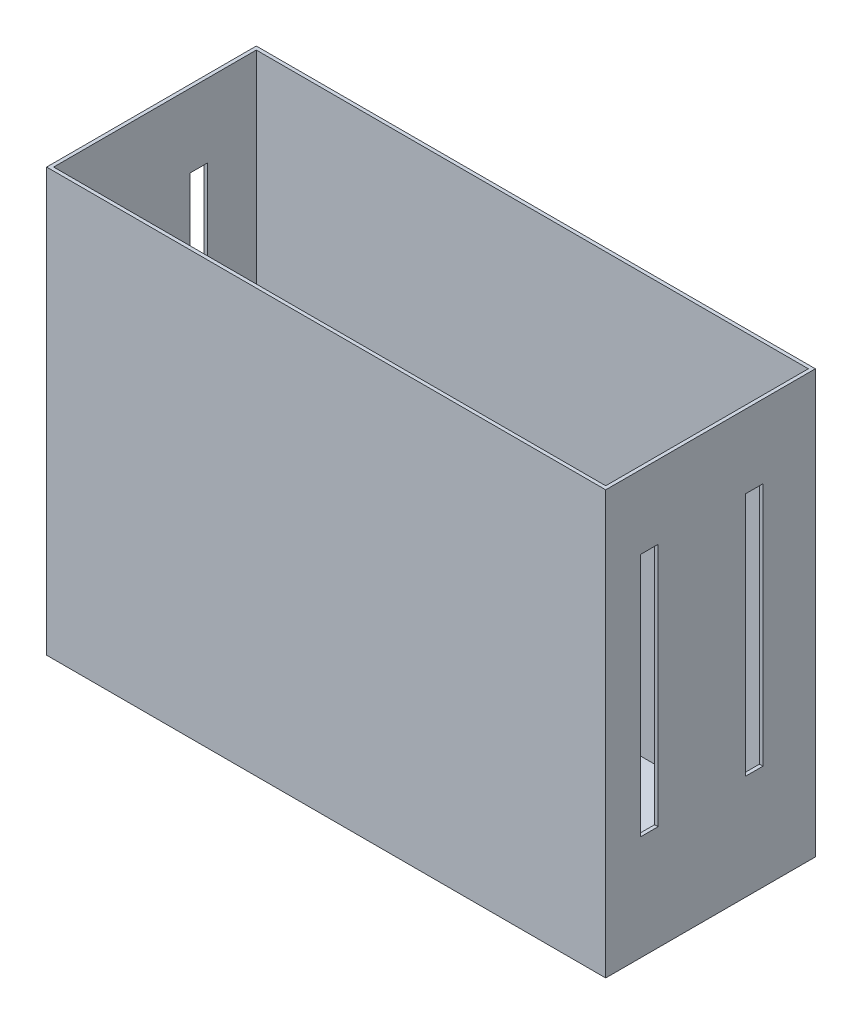
ISO-10303-21;
HEADER;
FILE_DESCRIPTION(('STEP AP214'),'2;1');
FILE_NAME('part.step','',(''),(''),'','','');
FILE_SCHEMA(('AUTOMOTIVE_DESIGN { 1 0 10303 214 1 1 1 1 }'));
ENDSEC;
DATA;
#1=APPLICATION_CONTEXT('core data for automotive mechanical design processes');
#2=APPLICATION_PROTOCOL_DEFINITION('international standard','automotive_design',2000,#1);
#3=PRODUCT_CONTEXT('',#1,'mechanical');
#4=PRODUCT('Part','Part','',(#3));
#5=PRODUCT_RELATED_PRODUCT_CATEGORY('part','',(#4));
#6=PRODUCT_DEFINITION_FORMATION('','',#4);
#7=PRODUCT_DEFINITION_CONTEXT('part definition',#1,'design');
#8=PRODUCT_DEFINITION('design','',#6,#7);
#9=PRODUCT_DEFINITION_SHAPE('','',#8);
#10=(LENGTH_UNIT() NAMED_UNIT(*) SI_UNIT(.MILLI.,.METRE.));
#11=(NAMED_UNIT(*) PLANE_ANGLE_UNIT() SI_UNIT($,.RADIAN.));
#12=(NAMED_UNIT(*) SI_UNIT($,.STERADIAN.) SOLID_ANGLE_UNIT());
#13=UNCERTAINTY_MEASURE_WITH_UNIT(LENGTH_MEASURE(1.E-05),#10,'distance_accuracy_value','');
#14=(GEOMETRIC_REPRESENTATION_CONTEXT(3) GLOBAL_UNCERTAINTY_ASSIGNED_CONTEXT((#13)) GLOBAL_UNIT_ASSIGNED_CONTEXT((#10,
#11,#12)) REPRESENTATION_CONTEXT('',''));
#15=CARTESIAN_POINT('',(0.,0.,0.));
#16=DIRECTION('',(0.,0.,1.));
#17=DIRECTION('',(1.,0.,0.));
#18=AXIS2_PLACEMENT_3D('',#15,#16,#17);
#19=CARTESIAN_POINT('',(0.,304.8,0.));
#20=DIRECTION('',(0.,1.,0.));
#21=DIRECTION('',(0.,0.,1.));
#22=AXIS2_PLACEMENT_3D('',#19,#20,#21);
#23=PLANE('',#22);
#24=DIRECTION('',(0.,0.,1.));
#25=VECTOR('',#24,1.);
#26=CARTESIAN_POINT('',(-203.2,304.8,-76.2));
#27=LINE('',#26,#25);
#28=CARTESIAN_POINT('',(-203.2,304.8,-76.2));
#29=VERTEX_POINT('',#28);
#30=CARTESIAN_POINT('',(-203.2,304.8,76.2));
#31=VERTEX_POINT('',#30);
#32=EDGE_CURVE('E346',#29,#31,#27,.T.);
#33=ORIENTED_EDGE('',*,*,#32,.T.);
#34=DIRECTION('',(1.,0.,0.));
#35=VECTOR('',#34,1.);
#36=CARTESIAN_POINT('',(-203.2,304.8,76.2));
#37=LINE('',#36,#35);
#38=CARTESIAN_POINT('',(203.2,304.8,76.2));
#39=VERTEX_POINT('',#38);
#40=EDGE_CURVE('E349',#31,#39,#37,.T.);
#41=ORIENTED_EDGE('',*,*,#40,.T.);
#42=DIRECTION('',(0.,0.,-1.));
#43=VECTOR('',#42,1.);
#44=CARTESIAN_POINT('',(203.2,304.8,-76.2));
#45=LINE('',#44,#43);
#46=CARTESIAN_POINT('',(203.2,304.8,-76.2));
#47=VERTEX_POINT('',#46);
#48=EDGE_CURVE('E351',#39,#47,#45,.T.);
#49=ORIENTED_EDGE('',*,*,#48,.T.);
#50=DIRECTION('',(-1.,0.,0.));
#51=VECTOR('',#50,1.);
#52=CARTESIAN_POINT('',(-203.2,304.8,-76.2));
#53=LINE('',#52,#51);
#54=EDGE_CURVE('E353',#47,#29,#53,.T.);
#55=ORIENTED_EDGE('',*,*,#54,.T.);
#56=EDGE_LOOP('',(#33,#41,#49,#55));
#57=FACE_BOUND('',#56,.T.);
#58=DIRECTION('',(1.,0.,0.));
#59=VECTOR('',#58,1.);
#60=CARTESIAN_POINT('',(-200.66,304.8,73.66));
#61=LINE('',#60,#59);
#62=CARTESIAN_POINT('',(-200.66,304.8,73.66));
#63=VERTEX_POINT('',#62);
#64=CARTESIAN_POINT('',(200.66,304.8,73.66));
#65=VERTEX_POINT('',#64);
#66=EDGE_CURVE('E319',#63,#65,#61,.T.);
#67=ORIENTED_EDGE('',*,*,#66,.F.);
#68=DIRECTION('',(0.,0.,1.));
#69=VECTOR('',#68,1.);
#70=CARTESIAN_POINT('',(-200.66,304.8,-73.66));
#71=LINE('',#70,#69);
#72=CARTESIAN_POINT('',(-200.66,304.8,-73.66));
#73=VERTEX_POINT('',#72);
#74=EDGE_CURVE('E317',#73,#63,#71,.T.);
#75=ORIENTED_EDGE('',*,*,#74,.F.);
#76=DIRECTION('',(-1.,0.,0.));
#77=VECTOR('',#76,1.);
#78=CARTESIAN_POINT('',(-200.66,304.8,-73.66));
#79=LINE('',#78,#77);
#80=CARTESIAN_POINT('',(200.66,304.8,-73.66));
#81=VERTEX_POINT('',#80);
#82=EDGE_CURVE('E325',#81,#73,#79,.T.);
#83=ORIENTED_EDGE('',*,*,#82,.F.);
#84=DIRECTION('',(0.,0.,-1.));
#85=VECTOR('',#84,1.);
#86=CARTESIAN_POINT('',(200.66,304.8,-73.66));
#87=LINE('',#86,#85);
#88=EDGE_CURVE('E322',#65,#81,#87,.T.);
#89=ORIENTED_EDGE('',*,*,#88,.F.);
#90=EDGE_LOOP('',(#67,#75,#83,#89));
#91=FACE_BOUND('',#90,.T.);
#92=ADVANCED_FACE('F38',(#57,#91),#23,.T.);
#93=CARTESIAN_POINT('',(-203.2,304.8,-76.2));
#94=DIRECTION('',(1.,0.,0.));
#95=DIRECTION('',(0.,0.,-1.));
#96=AXIS2_PLACEMENT_3D('',#93,#94,#95);
#97=PLANE('',#96);
#98=DIRECTION('',(0.,0.,-1.));
#99=VECTOR('',#98,1.);
#100=CARTESIAN_POINT('',(-203.2,73.66,-76.2));
#101=LINE('',#100,#99);
#102=CARTESIAN_POINT('',(-203.2,73.66,50.8));
#103=VERTEX_POINT('',#102);
#104=CARTESIAN_POINT('',(-203.2,73.66,38.1));
#105=VERTEX_POINT('',#104);
#106=EDGE_CURVE('E285',#103,#105,#101,.T.);
#107=ORIENTED_EDGE('',*,*,#106,.T.);
#108=DIRECTION('',(0.,1.,0.));
#109=VECTOR('',#108,1.);
#110=CARTESIAN_POINT('',(-203.2,304.8,38.1));
#111=LINE('',#110,#109);
#112=CARTESIAN_POINT('',(-203.2,251.46,38.1));
#113=VERTEX_POINT('',#112);
#114=EDGE_CURVE('E301',#105,#113,#111,.T.);
#115=ORIENTED_EDGE('',*,*,#114,.T.);
#116=DIRECTION('',(0.,0.,1.));
#117=VECTOR('',#116,1.);
#118=CARTESIAN_POINT('',(-203.2,251.46,-76.2));
#119=LINE('',#118,#117);
#120=CARTESIAN_POINT('',(-203.2,251.46,50.8));
#121=VERTEX_POINT('',#120);
#122=EDGE_CURVE('E296',#113,#121,#119,.T.);
#123=ORIENTED_EDGE('',*,*,#122,.T.);
#124=DIRECTION('',(0.,-1.,0.));
#125=VECTOR('',#124,1.);
#126=CARTESIAN_POINT('',(-203.2,304.8,50.8));
#127=LINE('',#126,#125);
#128=EDGE_CURVE('E291',#121,#103,#127,.T.);
#129=ORIENTED_EDGE('',*,*,#128,.T.);
#130=EDGE_LOOP('',(#107,#115,#123,#129));
#131=FACE_BOUND('',#130,.T.);
#132=DIRECTION('',(0.,0.,-1.));
#133=VECTOR('',#132,1.);
#134=CARTESIAN_POINT('',(-203.2,73.6600000000001,-76.2000000000003));
#135=LINE('',#134,#133);
#136=CARTESIAN_POINT('',(-203.2,73.66,-25.4));
#137=VERTEX_POINT('',#136);
#138=CARTESIAN_POINT('',(-203.2,73.66,-38.1));
#139=VERTEX_POINT('',#138);
#140=EDGE_CURVE('E264',#137,#139,#135,.T.);
#141=ORIENTED_EDGE('',*,*,#140,.T.);
#142=DIRECTION('',(0.,1.,0.));
#143=VECTOR('',#142,1.);
#144=CARTESIAN_POINT('',(-203.2,304.8,-38.1));
#145=LINE('',#144,#143);
#146=CARTESIAN_POINT('',(-203.2,251.46,-38.1));
#147=VERTEX_POINT('',#146);
#148=EDGE_CURVE('E280',#139,#147,#145,.T.);
#149=ORIENTED_EDGE('',*,*,#148,.T.);
#150=DIRECTION('',(0.,0.,1.));
#151=VECTOR('',#150,1.);
#152=CARTESIAN_POINT('',(-203.2,251.46,-76.2));
#153=LINE('',#152,#151);
#154=CARTESIAN_POINT('',(-203.2,251.46,-25.4));
#155=VERTEX_POINT('',#154);
#156=EDGE_CURVE('E275',#147,#155,#153,.T.);
#157=ORIENTED_EDGE('',*,*,#156,.T.);
#158=DIRECTION('',(0.,-1.,0.));
#159=VECTOR('',#158,1.);
#160=CARTESIAN_POINT('',(-203.2,304.8,-25.4));
#161=LINE('',#160,#159);
#162=EDGE_CURVE('E270',#155,#137,#161,.T.);
#163=ORIENTED_EDGE('',*,*,#162,.T.);
#164=EDGE_LOOP('',(#141,#149,#157,#163));
#165=FACE_BOUND('',#164,.T.);
#166=DIRECTION('',(0.,-1.,0.));
#167=VECTOR('',#166,1.);
#168=CARTESIAN_POINT('',(-203.2,304.8,-76.2));
#169=LINE('',#168,#167);
#170=CARTESIAN_POINT('',(-203.2,-2.54,-76.2));
#171=VERTEX_POINT('',#170);
#172=EDGE_CURVE('E355',#29,#171,#169,.T.);
#173=ORIENTED_EDGE('',*,*,#172,.T.);
#174=DIRECTION('',(0.,0.,-1.));
#175=VECTOR('',#174,1.);
#176=CARTESIAN_POINT('',(-203.2,-2.54,-76.2));
#177=LINE('',#176,#175);
#178=CARTESIAN_POINT('',(-203.2,-2.54,76.2));
#179=VERTEX_POINT('',#178);
#180=EDGE_CURVE('E307',#179,#171,#177,.T.);
#181=ORIENTED_EDGE('',*,*,#180,.F.);
#182=DIRECTION('',(0.,-1.,0.));
#183=VECTOR('',#182,1.);
#184=CARTESIAN_POINT('',(-203.2,304.8,76.2));
#185=LINE('',#184,#183);
#186=EDGE_CURVE('E361',#31,#179,#185,.T.);
#187=ORIENTED_EDGE('',*,*,#186,.F.);
#188=ORIENTED_EDGE('',*,*,#32,.F.);
#189=EDGE_LOOP('',(#173,#181,#187,#188));
#190=FACE_BOUND('',#189,.T.);
#191=ADVANCED_FACE('F40',(#131,#165,#190),#97,.F.);
#192=CARTESIAN_POINT('',(-203.2,304.8,76.2));
#193=DIRECTION('',(0.,0.,-1.));
#194=DIRECTION('',(-1.,0.,0.));
#195=AXIS2_PLACEMENT_3D('',#192,#193,#194);
#196=PLANE('',#195);
#197=ORIENTED_EDGE('',*,*,#186,.T.);
#198=DIRECTION('',(-1.,0.,0.));
#199=VECTOR('',#198,1.);
#200=CARTESIAN_POINT('',(-203.2,-2.54,76.2));
#201=LINE('',#200,#199);
#202=CARTESIAN_POINT('',(203.2,-2.54,76.2));
#203=VERTEX_POINT('',#202);
#204=EDGE_CURVE('E304',#203,#179,#201,.T.);
#205=ORIENTED_EDGE('',*,*,#204,.F.);
#206=DIRECTION('',(0.,-1.,0.));
#207=VECTOR('',#206,1.);
#208=CARTESIAN_POINT('',(203.2,304.8,76.2));
#209=LINE('',#208,#207);
#210=EDGE_CURVE('E359',#39,#203,#209,.T.);
#211=ORIENTED_EDGE('',*,*,#210,.F.);
#212=ORIENTED_EDGE('',*,*,#40,.F.);
#213=EDGE_LOOP('',(#197,#205,#211,#212));
#214=FACE_BOUND('',#213,.T.);
#215=ADVANCED_FACE('F404',(#214),#196,.F.);
#216=CARTESIAN_POINT('',(203.2,304.8,-76.2));
#217=DIRECTION('',(-1.,0.,0.));
#218=DIRECTION('',(0.,0.,1.));
#219=AXIS2_PLACEMENT_3D('',#216,#217,#218);
#220=PLANE('',#219);
#221=DIRECTION('',(0.,0.,-1.));
#222=VECTOR('',#221,1.);
#223=CARTESIAN_POINT('',(203.2,251.46,38.1));
#224=LINE('',#223,#222);
#225=CARTESIAN_POINT('',(203.2,251.46,50.8));
#226=VERTEX_POINT('',#225);
#227=CARTESIAN_POINT('',(203.2,251.46,38.1));
#228=VERTEX_POINT('',#227);
#229=EDGE_CURVE('E223',#226,#228,#224,.T.);
#230=ORIENTED_EDGE('',*,*,#229,.T.);
#231=DIRECTION('',(0.,-1.,0.));
#232=VECTOR('',#231,1.);
#233=CARTESIAN_POINT('',(203.2,251.46,38.1));
#234=LINE('',#233,#232);
#235=CARTESIAN_POINT('',(203.2,73.66,38.1));
#236=VERTEX_POINT('',#235);
#237=EDGE_CURVE('E203',#228,#236,#234,.T.);
#238=ORIENTED_EDGE('',*,*,#237,.T.);
#239=DIRECTION('',(0.,0.,1.));
#240=VECTOR('',#239,1.);
#241=CARTESIAN_POINT('',(203.2,73.66,38.1));
#242=LINE('',#241,#240);
#243=CARTESIAN_POINT('',(203.2,73.66,50.8));
#244=VERTEX_POINT('',#243);
#245=EDGE_CURVE('E212',#236,#244,#242,.T.);
#246=ORIENTED_EDGE('',*,*,#245,.T.);
#247=DIRECTION('',(0.,1.,0.));
#248=VECTOR('',#247,1.);
#249=CARTESIAN_POINT('',(203.2,251.46,50.8));
#250=LINE('',#249,#248);
#251=EDGE_CURVE('E218',#244,#226,#250,.T.);
#252=ORIENTED_EDGE('',*,*,#251,.T.);
#253=EDGE_LOOP('',(#230,#238,#246,#252));
#254=FACE_BOUND('',#253,.T.);
#255=DIRECTION('',(0.,0.,-1.));
#256=VECTOR('',#255,1.);
#257=CARTESIAN_POINT('',(203.2,251.46,-25.4));
#258=LINE('',#257,#256);
#259=CARTESIAN_POINT('',(203.2,251.46,-25.4));
#260=VERTEX_POINT('',#259);
#261=CARTESIAN_POINT('',(203.2,251.46,-38.1));
#262=VERTEX_POINT('',#261);
#263=EDGE_CURVE('E243',#260,#262,#258,.T.);
#264=ORIENTED_EDGE('',*,*,#263,.T.);
#265=DIRECTION('',(0.,-1.,0.));
#266=VECTOR('',#265,1.);
#267=CARTESIAN_POINT('',(203.2,73.66,-38.1));
#268=LINE('',#267,#266);
#269=CARTESIAN_POINT('',(203.2,73.66,-38.1));
#270=VERTEX_POINT('',#269);
#271=EDGE_CURVE('E224',#262,#270,#268,.T.);
#272=ORIENTED_EDGE('',*,*,#271,.T.);
#273=DIRECTION('',(0.,0.,1.));
#274=VECTOR('',#273,1.);
#275=CARTESIAN_POINT('',(203.2,73.66,-25.4));
#276=LINE('',#275,#274);
#277=CARTESIAN_POINT('',(203.2,73.66,-25.4));
#278=VERTEX_POINT('',#277);
#279=EDGE_CURVE('E227',#270,#278,#276,.T.);
#280=ORIENTED_EDGE('',*,*,#279,.T.);
#281=DIRECTION('',(0.,1.,0.));
#282=VECTOR('',#281,1.);
#283=CARTESIAN_POINT('',(203.2,73.66,-25.4));
#284=LINE('',#283,#282);
#285=EDGE_CURVE('E258',#278,#260,#284,.T.);
#286=ORIENTED_EDGE('',*,*,#285,.T.);
#287=EDGE_LOOP('',(#264,#272,#280,#286));
#288=FACE_BOUND('',#287,.T.);
#289=ORIENTED_EDGE('',*,*,#210,.T.);
#290=DIRECTION('',(0.,0.,1.));
#291=VECTOR('',#290,1.);
#292=CARTESIAN_POINT('',(203.2,-2.54,76.2));
#293=LINE('',#292,#291);
#294=CARTESIAN_POINT('',(203.2,-2.54,-76.2));
#295=VERTEX_POINT('',#294);
#296=EDGE_CURVE('E313',#295,#203,#293,.T.);
#297=ORIENTED_EDGE('',*,*,#296,.F.);
#298=DIRECTION('',(0.,-1.,0.));
#299=VECTOR('',#298,1.);
#300=CARTESIAN_POINT('',(203.2,304.8,-76.2));
#301=LINE('',#300,#299);
#302=EDGE_CURVE('E357',#47,#295,#301,.T.);
#303=ORIENTED_EDGE('',*,*,#302,.F.);
#304=ORIENTED_EDGE('',*,*,#48,.F.);
#305=EDGE_LOOP('',(#289,#297,#303,#304));
#306=FACE_BOUND('',#305,.T.);
#307=ADVANCED_FACE('F220',(#254,#288,#306),#220,.F.);
#308=CARTESIAN_POINT('',(-203.2,304.8,-76.2));
#309=DIRECTION('',(0.,0.,1.));
#310=DIRECTION('',(1.,0.,0.));
#311=AXIS2_PLACEMENT_3D('',#308,#309,#310);
#312=PLANE('',#311);
#313=ORIENTED_EDGE('',*,*,#302,.T.);
#314=DIRECTION('',(1.,0.,0.));
#315=VECTOR('',#314,1.);
#316=CARTESIAN_POINT('',(203.2,-2.54,-76.2));
#317=LINE('',#316,#315);
#318=EDGE_CURVE('E310',#171,#295,#317,.T.);
#319=ORIENTED_EDGE('',*,*,#318,.F.);
#320=ORIENTED_EDGE('',*,*,#172,.F.);
#321=ORIENTED_EDGE('',*,*,#54,.F.);
#322=EDGE_LOOP('',(#313,#319,#320,#321));
#323=FACE_BOUND('',#322,.T.);
#324=ADVANCED_FACE('F411',(#323),#312,.F.);
#325=CARTESIAN_POINT('',(-200.66,304.8,-73.66));
#326=DIRECTION('',(1.,0.,0.));
#327=DIRECTION('',(0.,0.,-1.));
#328=AXIS2_PLACEMENT_3D('',#325,#326,#327);
#329=PLANE('',#328);
#330=DIRECTION('',(0.,1.,0.));
#331=VECTOR('',#330,1.);
#332=CARTESIAN_POINT('',(-200.66,304.8,38.1));
#333=LINE('',#332,#331);
#334=CARTESIAN_POINT('',(-200.66,73.66,38.1));
#335=VERTEX_POINT('',#334);
#336=CARTESIAN_POINT('',(-200.66,251.46,38.1));
#337=VERTEX_POINT('',#336);
#338=EDGE_CURVE('E299',#335,#337,#333,.T.);
#339=ORIENTED_EDGE('',*,*,#338,.F.);
#340=DIRECTION('',(0.,0.,-1.));
#341=VECTOR('',#340,1.);
#342=CARTESIAN_POINT('',(-200.66,73.66,-73.66));
#343=LINE('',#342,#341);
#344=CARTESIAN_POINT('',(-200.66,73.66,50.8));
#345=VERTEX_POINT('',#344);
#346=EDGE_CURVE('E283',#345,#335,#343,.T.);
#347=ORIENTED_EDGE('',*,*,#346,.F.);
#348=DIRECTION('',(0.,-1.,0.));
#349=VECTOR('',#348,1.);
#350=CARTESIAN_POINT('',(-200.66,304.8,50.8));
#351=LINE('',#350,#349);
#352=CARTESIAN_POINT('',(-200.66,251.46,50.8));
#353=VERTEX_POINT('',#352);
#354=EDGE_CURVE('E288',#353,#345,#351,.T.);
#355=ORIENTED_EDGE('',*,*,#354,.F.);
#356=DIRECTION('',(0.,0.,1.));
#357=VECTOR('',#356,1.);
#358=CARTESIAN_POINT('',(-200.66,251.46,-73.66));
#359=LINE('',#358,#357);
#360=EDGE_CURVE('E294',#337,#353,#359,.T.);
#361=ORIENTED_EDGE('',*,*,#360,.F.);
#362=EDGE_LOOP('',(#339,#347,#355,#361));
#363=FACE_BOUND('',#362,.T.);
#364=DIRECTION('',(0.,1.,0.));
#365=VECTOR('',#364,1.);
#366=CARTESIAN_POINT('',(-200.66,304.8,-38.1));
#367=LINE('',#366,#365);
#368=CARTESIAN_POINT('',(-200.66,73.66,-38.1));
#369=VERTEX_POINT('',#368);
#370=CARTESIAN_POINT('',(-200.66,251.46,-38.1));
#371=VERTEX_POINT('',#370);
#372=EDGE_CURVE('E278',#369,#371,#367,.T.);
#373=ORIENTED_EDGE('',*,*,#372,.F.);
#374=DIRECTION('',(0.,0.,-1.));
#375=VECTOR('',#374,1.);
#376=CARTESIAN_POINT('',(-200.66,73.6600000000001,-73.6600000000003));
#377=LINE('',#376,#375);
#378=CARTESIAN_POINT('',(-200.66,73.66,-25.4));
#379=VERTEX_POINT('',#378);
#380=EDGE_CURVE('E234',#379,#369,#377,.T.);
#381=ORIENTED_EDGE('',*,*,#380,.F.);
#382=DIRECTION('',(0.,-1.,0.));
#383=VECTOR('',#382,1.);
#384=CARTESIAN_POINT('',(-200.66,304.8,-25.4));
#385=LINE('',#384,#383);
#386=CARTESIAN_POINT('',(-200.66,251.46,-25.4));
#387=VERTEX_POINT('',#386);
#388=EDGE_CURVE('E267',#387,#379,#385,.T.);
#389=ORIENTED_EDGE('',*,*,#388,.F.);
#390=DIRECTION('',(0.,0.,1.));
#391=VECTOR('',#390,1.);
#392=CARTESIAN_POINT('',(-200.66,251.46,-73.66));
#393=LINE('',#392,#391);
#394=EDGE_CURVE('E273',#371,#387,#393,.T.);
#395=ORIENTED_EDGE('',*,*,#394,.F.);
#396=EDGE_LOOP('',(#373,#381,#389,#395));
#397=FACE_BOUND('',#396,.T.);
#398=DIRECTION('',(0.,0.,1.));
#399=VECTOR('',#398,1.);
#400=CARTESIAN_POINT('',(-200.66,0.,-73.66));
#401=LINE('',#400,#399);
#402=CARTESIAN_POINT('',(-200.66,0.,-73.66));
#403=VERTEX_POINT('',#402);
#404=CARTESIAN_POINT('',(-200.66,0.,73.66));
#405=VERTEX_POINT('',#404);
#406=EDGE_CURVE('E316',#403,#405,#401,.T.);
#407=ORIENTED_EDGE('',*,*,#406,.F.);
#408=DIRECTION('',(0.,-1.,0.));
#409=VECTOR('',#408,1.);
#410=CARTESIAN_POINT('',(-200.66,304.8,-73.66));
#411=LINE('',#410,#409);
#412=EDGE_CURVE('E327',#73,#403,#411,.T.);
#413=ORIENTED_EDGE('',*,*,#412,.F.);
#414=ORIENTED_EDGE('',*,*,#74,.T.);
#415=DIRECTION('',(0.,-1.,0.));
#416=VECTOR('',#415,1.);
#417=CARTESIAN_POINT('',(-200.66,304.8,73.66));
#418=LINE('',#417,#416);
#419=EDGE_CURVE('E343',#63,#405,#418,.T.);
#420=ORIENTED_EDGE('',*,*,#419,.T.);
#421=EDGE_LOOP('',(#407,#413,#414,#420));
#422=FACE_BOUND('',#421,.T.);
#423=ADVANCED_FACE('F409',(#363,#397,#422),#329,.T.);
#424=CARTESIAN_POINT('',(-200.66,304.8,73.66));
#425=DIRECTION('',(0.,0.,-1.));
#426=DIRECTION('',(-1.,0.,0.));
#427=AXIS2_PLACEMENT_3D('',#424,#425,#426);
#428=PLANE('',#427);
#429=DIRECTION('',(1.,0.,0.));
#430=VECTOR('',#429,1.);
#431=CARTESIAN_POINT('',(-200.66,0.,73.66));
#432=LINE('',#431,#430);
#433=CARTESIAN_POINT('',(200.66,0.,73.66));
#434=VERTEX_POINT('',#433);
#435=EDGE_CURVE('E330',#405,#434,#432,.T.);
#436=ORIENTED_EDGE('',*,*,#435,.F.);
#437=ORIENTED_EDGE('',*,*,#419,.F.);
#438=ORIENTED_EDGE('',*,*,#66,.T.);
#439=DIRECTION('',(0.,-1.,0.));
#440=VECTOR('',#439,1.);
#441=CARTESIAN_POINT('',(200.66,304.8,73.66));
#442=LINE('',#441,#440);
#443=EDGE_CURVE('E341',#65,#434,#442,.T.);
#444=ORIENTED_EDGE('',*,*,#443,.T.);
#445=EDGE_LOOP('',(#436,#437,#438,#444));
#446=FACE_BOUND('',#445,.T.);
#447=ADVANCED_FACE('F458',(#446),#428,.T.);
#448=CARTESIAN_POINT('',(200.66,304.8,-73.66));
#449=DIRECTION('',(-1.,0.,0.));
#450=DIRECTION('',(0.,0.,1.));
#451=AXIS2_PLACEMENT_3D('',#448,#449,#450);
#452=PLANE('',#451);
#453=DIRECTION('',(0.,-1.,0.));
#454=VECTOR('',#453,1.);
#455=CARTESIAN_POINT('',(200.66,304.8,38.1));
#456=LINE('',#455,#454);
#457=CARTESIAN_POINT('',(200.66,251.46,38.1));
#458=VERTEX_POINT('',#457);
#459=CARTESIAN_POINT('',(200.66,73.66,38.1));
#460=VERTEX_POINT('',#459);
#461=EDGE_CURVE('E11',#458,#460,#456,.T.);
#462=ORIENTED_EDGE('',*,*,#461,.F.);
#463=DIRECTION('',(0.,0.,-1.));
#464=VECTOR('',#463,1.);
#465=CARTESIAN_POINT('',(200.66,251.46,-73.66));
#466=LINE('',#465,#464);
#467=CARTESIAN_POINT('',(200.66,251.46,50.8));
#468=VERTEX_POINT('',#467);
#469=EDGE_CURVE('E46',#468,#458,#466,.T.);
#470=ORIENTED_EDGE('',*,*,#469,.F.);
#471=DIRECTION('',(0.,1.,0.));
#472=VECTOR('',#471,1.);
#473=CARTESIAN_POINT('',(200.66,304.8,50.8));
#474=LINE('',#473,#472);
#475=CARTESIAN_POINT('',(200.66,73.66,50.8));
#476=VERTEX_POINT('',#475);
#477=EDGE_CURVE('E374',#476,#468,#474,.T.);
#478=ORIENTED_EDGE('',*,*,#477,.F.);
#479=DIRECTION('',(0.,0.,1.));
#480=VECTOR('',#479,1.);
#481=CARTESIAN_POINT('',(200.66,73.66,-73.66));
#482=LINE('',#481,#480);
#483=EDGE_CURVE('E372',#460,#476,#482,.T.);
#484=ORIENTED_EDGE('',*,*,#483,.F.);
#485=EDGE_LOOP('',(#462,#470,#478,#484));
#486=FACE_BOUND('',#485,.T.);
#487=DIRECTION('',(0.,-1.,0.));
#488=VECTOR('',#487,1.);
#489=CARTESIAN_POINT('',(200.66,304.8,-38.1));
#490=LINE('',#489,#488);
#491=CARTESIAN_POINT('',(200.66,251.46,-38.1));
#492=VERTEX_POINT('',#491);
#493=CARTESIAN_POINT('',(200.66,73.66,-38.1));
#494=VERTEX_POINT('',#493);
#495=EDGE_CURVE('E369',#492,#494,#490,.T.);
#496=ORIENTED_EDGE('',*,*,#495,.F.);
#497=DIRECTION('',(0.,0.,-1.));
#498=VECTOR('',#497,1.);
#499=CARTESIAN_POINT('',(200.66,251.46,-73.66));
#500=LINE('',#499,#498);
#501=CARTESIAN_POINT('',(200.66,251.46,-25.4));
#502=VERTEX_POINT('',#501);
#503=EDGE_CURVE('E367',#502,#492,#500,.T.);
#504=ORIENTED_EDGE('',*,*,#503,.F.);
#505=DIRECTION('',(0.,1.,0.));
#506=VECTOR('',#505,1.);
#507=CARTESIAN_POINT('',(200.66,304.8,-25.4));
#508=LINE('',#507,#506);
#509=CARTESIAN_POINT('',(200.66,73.66,-25.4));
#510=VERTEX_POINT('',#509);
#511=EDGE_CURVE('E365',#510,#502,#508,.T.);
#512=ORIENTED_EDGE('',*,*,#511,.F.);
#513=DIRECTION('',(0.,0.,1.));
#514=VECTOR('',#513,1.);
#515=CARTESIAN_POINT('',(200.66,73.6600000000001,-73.6600000000003));
#516=LINE('',#515,#514);
#517=EDGE_CURVE('E363',#494,#510,#516,.T.);
#518=ORIENTED_EDGE('',*,*,#517,.F.);
#519=EDGE_LOOP('',(#496,#504,#512,#518));
#520=FACE_BOUND('',#519,.T.);
#521=DIRECTION('',(0.,0.,-1.));
#522=VECTOR('',#521,1.);
#523=CARTESIAN_POINT('',(200.66,0.,-73.66));
#524=LINE('',#523,#522);
#525=CARTESIAN_POINT('',(200.66,0.,-73.66));
#526=VERTEX_POINT('',#525);
#527=EDGE_CURVE('E333',#434,#526,#524,.T.);
#528=ORIENTED_EDGE('',*,*,#527,.F.);
#529=ORIENTED_EDGE('',*,*,#443,.F.);
#530=ORIENTED_EDGE('',*,*,#88,.T.);
#531=DIRECTION('',(0.,-1.,0.));
#532=VECTOR('',#531,1.);
#533=CARTESIAN_POINT('',(200.66,304.8,-73.66));
#534=LINE('',#533,#532);
#535=EDGE_CURVE('E339',#81,#526,#534,.T.);
#536=ORIENTED_EDGE('',*,*,#535,.T.);
#537=EDGE_LOOP('',(#528,#529,#530,#536));
#538=FACE_BOUND('',#537,.T.);
#539=ADVANCED_FACE('F380',(#486,#520,#538),#452,.T.);
#540=CARTESIAN_POINT('',(-200.66,304.8,-73.66));
#541=DIRECTION('',(0.,0.,1.));
#542=DIRECTION('',(1.,0.,0.));
#543=AXIS2_PLACEMENT_3D('',#540,#541,#542);
#544=PLANE('',#543);
#545=DIRECTION('',(-1.,0.,0.));
#546=VECTOR('',#545,1.);
#547=CARTESIAN_POINT('',(-200.66,0.,-73.66));
#548=LINE('',#547,#546);
#549=EDGE_CURVE('E320',#526,#403,#548,.T.);
#550=ORIENTED_EDGE('',*,*,#549,.F.);
#551=ORIENTED_EDGE('',*,*,#535,.F.);
#552=ORIENTED_EDGE('',*,*,#82,.T.);
#553=ORIENTED_EDGE('',*,*,#412,.T.);
#554=EDGE_LOOP('',(#550,#551,#552,#553));
#555=FACE_BOUND('',#554,.T.);
#556=ADVANCED_FACE('F447',(#555),#544,.T.);
#557=CARTESIAN_POINT('',(0.,0.,0.));
#558=DIRECTION('',(0.,1.,0.));
#559=DIRECTION('',(0.,0.,1.));
#560=AXIS2_PLACEMENT_3D('',#557,#558,#559);
#561=PLANE('',#560);
#562=ORIENTED_EDGE('',*,*,#549,.T.);
#563=ORIENTED_EDGE('',*,*,#406,.T.);
#564=ORIENTED_EDGE('',*,*,#435,.T.);
#565=ORIENTED_EDGE('',*,*,#527,.T.);
#566=EDGE_LOOP('',(#562,#563,#564,#565));
#567=FACE_BOUND('',#566,.T.);
#568=ADVANCED_FACE('F437',(#567),#561,.T.);
#569=CARTESIAN_POINT('',(0.,-2.54,0.));
#570=DIRECTION('',(0.,1.,0.));
#571=DIRECTION('',(0.,0.,1.));
#572=AXIS2_PLACEMENT_3D('',#569,#570,#571);
#573=PLANE('',#572);
#574=ORIENTED_EDGE('',*,*,#204,.T.);
#575=ORIENTED_EDGE('',*,*,#180,.T.);
#576=ORIENTED_EDGE('',*,*,#318,.T.);
#577=ORIENTED_EDGE('',*,*,#296,.T.);
#578=EDGE_LOOP('',(#574,#575,#576,#577));
#579=FACE_BOUND('',#578,.T.);
#580=ADVANCED_FACE('F429',(#579),#573,.F.);
#581=CARTESIAN_POINT('',(203.2,73.66,-25.4));
#582=DIRECTION('',(0.,-1.,0.));
#583=DIRECTION('',(0.,0.,-1.));
#584=AXIS2_PLACEMENT_3D('',#581,#582,#583);
#585=PLANE('',#584);
#586=ORIENTED_EDGE('',*,*,#517,.T.);
#587=DIRECTION('',(-1.,0.,0.));
#588=VECTOR('',#587,1.);
#589=CARTESIAN_POINT('',(203.2,73.66,-25.4));
#590=LINE('',#589,#588);
#591=EDGE_CURVE('E244',#278,#510,#590,.T.);
#592=ORIENTED_EDGE('',*,*,#591,.F.);
#593=ORIENTED_EDGE('',*,*,#279,.F.);
#594=DIRECTION('',(-1.,0.,0.));
#595=VECTOR('',#594,1.);
#596=CARTESIAN_POINT('',(203.2,73.66,-38.1));
#597=LINE('',#596,#595);
#598=EDGE_CURVE('E241',#270,#494,#597,.T.);
#599=ORIENTED_EDGE('',*,*,#598,.T.);
#600=EDGE_LOOP('',(#586,#592,#593,#599));
#601=FACE_BOUND('',#600,.T.);
#602=ADVANCED_FACE('F436',(#601),#585,.F.);
#603=CARTESIAN_POINT('',(203.2,73.66,-25.4));
#604=DIRECTION('',(0.,0.,1.));
#605=DIRECTION('',(0.,-1.,0.));
#606=AXIS2_PLACEMENT_3D('',#603,#604,#605);
#607=PLANE('',#606);
#608=ORIENTED_EDGE('',*,*,#511,.T.);
#609=DIRECTION('',(-1.,0.,0.));
#610=VECTOR('',#609,1.);
#611=CARTESIAN_POINT('',(203.2,251.46,-25.4));
#612=LINE('',#611,#610);
#613=EDGE_CURVE('E248',#260,#502,#612,.T.);
#614=ORIENTED_EDGE('',*,*,#613,.F.);
#615=ORIENTED_EDGE('',*,*,#285,.F.);
#616=ORIENTED_EDGE('',*,*,#591,.T.);
#617=EDGE_LOOP('',(#608,#614,#615,#616));
#618=FACE_BOUND('',#617,.T.);
#619=ADVANCED_FACE('F443',(#618),#607,.F.);
#620=CARTESIAN_POINT('',(203.2,251.46,-25.4));
#621=DIRECTION('',(0.,1.,0.));
#622=DIRECTION('',(0.,0.,1.));
#623=AXIS2_PLACEMENT_3D('',#620,#621,#622);
#624=PLANE('',#623);
#625=ORIENTED_EDGE('',*,*,#503,.T.);
#626=DIRECTION('',(-1.,0.,0.));
#627=VECTOR('',#626,1.);
#628=CARTESIAN_POINT('',(203.2,251.46,-38.1));
#629=LINE('',#628,#627);
#630=EDGE_CURVE('E252',#262,#492,#629,.T.);
#631=ORIENTED_EDGE('',*,*,#630,.F.);
#632=ORIENTED_EDGE('',*,*,#263,.F.);
#633=ORIENTED_EDGE('',*,*,#613,.T.);
#634=EDGE_LOOP('',(#625,#631,#632,#633));
#635=FACE_BOUND('',#634,.T.);
#636=ADVANCED_FACE('F451',(#635),#624,.F.);
#637=CARTESIAN_POINT('',(203.2,73.66,-38.1));
#638=DIRECTION('',(0.,0.,-1.));
#639=DIRECTION('',(-1.,0.,0.));
#640=AXIS2_PLACEMENT_3D('',#637,#638,#639);
#641=PLANE('',#640);
#642=ORIENTED_EDGE('',*,*,#495,.T.);
#643=ORIENTED_EDGE('',*,*,#598,.F.);
#644=ORIENTED_EDGE('',*,*,#271,.F.);
#645=ORIENTED_EDGE('',*,*,#630,.T.);
#646=EDGE_LOOP('',(#642,#643,#644,#645));
#647=FACE_BOUND('',#646,.T.);
#648=ADVANCED_FACE('F393',(#647),#641,.F.);
#649=CARTESIAN_POINT('',(203.2,73.66,38.1));
#650=DIRECTION('',(0.,-1.,0.));
#651=DIRECTION('',(0.,0.,-1.));
#652=AXIS2_PLACEMENT_3D('',#649,#650,#651);
#653=PLANE('',#652);
#654=ORIENTED_EDGE('',*,*,#483,.T.);
#655=DIRECTION('',(-1.,0.,0.));
#656=VECTOR('',#655,1.);
#657=CARTESIAN_POINT('',(203.2,73.66,50.8));
#658=LINE('',#657,#656);
#659=EDGE_CURVE('E215',#244,#476,#658,.T.);
#660=ORIENTED_EDGE('',*,*,#659,.F.);
#661=ORIENTED_EDGE('',*,*,#245,.F.);
#662=DIRECTION('',(-1.,0.,0.));
#663=VECTOR('',#662,1.);
#664=CARTESIAN_POINT('',(203.2,73.66,38.1));
#665=LINE('',#664,#663);
#666=EDGE_CURVE('E198',#236,#460,#665,.T.);
#667=ORIENTED_EDGE('',*,*,#666,.T.);
#668=EDGE_LOOP('',(#654,#660,#661,#667));
#669=FACE_BOUND('',#668,.T.);
#670=ADVANCED_FACE('F213',(#669),#653,.F.);
#671=CARTESIAN_POINT('',(203.2,251.46,50.8));
#672=DIRECTION('',(0.,0.,1.));
#673=DIRECTION('',(0.,-1.,0.));
#674=AXIS2_PLACEMENT_3D('',#671,#672,#673);
#675=PLANE('',#674);
#676=ORIENTED_EDGE('',*,*,#477,.T.);
#677=DIRECTION('',(-1.,0.,0.));
#678=VECTOR('',#677,1.);
#679=CARTESIAN_POINT('',(203.2,251.46,50.8));
#680=LINE('',#679,#678);
#681=EDGE_CURVE('E236',#226,#468,#680,.T.);
#682=ORIENTED_EDGE('',*,*,#681,.F.);
#683=ORIENTED_EDGE('',*,*,#251,.F.);
#684=ORIENTED_EDGE('',*,*,#659,.T.);
#685=EDGE_LOOP('',(#676,#682,#683,#684));
#686=FACE_BOUND('',#685,.T.);
#687=ADVANCED_FACE('F383',(#686),#675,.F.);
#688=CARTESIAN_POINT('',(203.2,251.46,38.1));
#689=DIRECTION('',(0.,1.,0.));
#690=DIRECTION('',(0.,0.,1.));
#691=AXIS2_PLACEMENT_3D('',#688,#689,#690);
#692=PLANE('',#691);
#693=ORIENTED_EDGE('',*,*,#469,.T.);
#694=DIRECTION('',(-1.,0.,0.));
#695=VECTOR('',#694,1.);
#696=CARTESIAN_POINT('',(203.2,251.46,38.1));
#697=LINE('',#696,#695);
#698=EDGE_CURVE('E232',#228,#458,#697,.T.);
#699=ORIENTED_EDGE('',*,*,#698,.F.);
#700=ORIENTED_EDGE('',*,*,#229,.F.);
#701=ORIENTED_EDGE('',*,*,#681,.T.);
#702=EDGE_LOOP('',(#693,#699,#700,#701));
#703=FACE_BOUND('',#702,.T.);
#704=ADVANCED_FACE('F377',(#703),#692,.F.);
#705=CARTESIAN_POINT('',(203.2,251.46,38.1));
#706=DIRECTION('',(0.,0.,-1.));
#707=DIRECTION('',(0.,1.,0.));
#708=AXIS2_PLACEMENT_3D('',#705,#706,#707);
#709=PLANE('',#708);
#710=ORIENTED_EDGE('',*,*,#461,.T.);
#711=ORIENTED_EDGE('',*,*,#666,.F.);
#712=ORIENTED_EDGE('',*,*,#237,.F.);
#713=ORIENTED_EDGE('',*,*,#698,.T.);
#714=EDGE_LOOP('',(#710,#711,#712,#713));
#715=FACE_BOUND('',#714,.T.);
#716=ADVANCED_FACE('F200',(#715),#709,.F.);
#717=EDGE_CURVE('E61',#369,#139,#597,.T.);
#718=ORIENTED_EDGE('',*,*,#717,.F.);
#719=ORIENTED_EDGE('',*,*,#372,.T.);
#720=EDGE_CURVE('E255',#371,#147,#629,.T.);
#721=ORIENTED_EDGE('',*,*,#720,.T.);
#722=ORIENTED_EDGE('',*,*,#148,.F.);
#723=EDGE_LOOP('',(#718,#719,#721,#722));
#724=FACE_BOUND('',#723,.T.);
#725=ADVANCED_FACE('F490',(#724),#641,.F.);
#726=ORIENTED_EDGE('',*,*,#720,.F.);
#727=ORIENTED_EDGE('',*,*,#394,.T.);
#728=EDGE_CURVE('E251',#387,#155,#612,.T.);
#729=ORIENTED_EDGE('',*,*,#728,.T.);
#730=ORIENTED_EDGE('',*,*,#156,.F.);
#731=EDGE_LOOP('',(#726,#727,#729,#730));
#732=FACE_BOUND('',#731,.T.);
#733=ADVANCED_FACE('F492',(#732),#624,.F.);
#734=ORIENTED_EDGE('',*,*,#728,.F.);
#735=ORIENTED_EDGE('',*,*,#388,.T.);
#736=EDGE_CURVE('E247',#379,#137,#590,.T.);
#737=ORIENTED_EDGE('',*,*,#736,.T.);
#738=ORIENTED_EDGE('',*,*,#162,.F.);
#739=EDGE_LOOP('',(#734,#735,#737,#738));
#740=FACE_BOUND('',#739,.T.);
#741=ADVANCED_FACE('F498',(#740),#607,.F.);
#742=ORIENTED_EDGE('',*,*,#736,.F.);
#743=ORIENTED_EDGE('',*,*,#380,.T.);
#744=ORIENTED_EDGE('',*,*,#717,.T.);
#745=ORIENTED_EDGE('',*,*,#140,.F.);
#746=EDGE_LOOP('',(#742,#743,#744,#745));
#747=FACE_BOUND('',#746,.T.);
#748=ADVANCED_FACE('F446',(#747),#585,.F.);
#749=EDGE_CURVE('E53',#335,#105,#665,.T.);
#750=ORIENTED_EDGE('',*,*,#749,.F.);
#751=ORIENTED_EDGE('',*,*,#338,.T.);
#752=EDGE_CURVE('E235',#337,#113,#697,.T.);
#753=ORIENTED_EDGE('',*,*,#752,.T.);
#754=ORIENTED_EDGE('',*,*,#114,.F.);
#755=EDGE_LOOP('',(#750,#751,#753,#754));
#756=FACE_BOUND('',#755,.T.);
#757=ADVANCED_FACE('F504',(#756),#709,.F.);
#758=ORIENTED_EDGE('',*,*,#752,.F.);
#759=ORIENTED_EDGE('',*,*,#360,.T.);
#760=EDGE_CURVE('E239',#353,#121,#680,.T.);
#761=ORIENTED_EDGE('',*,*,#760,.T.);
#762=ORIENTED_EDGE('',*,*,#122,.F.);
#763=EDGE_LOOP('',(#758,#759,#761,#762));
#764=FACE_BOUND('',#763,.T.);
#765=ADVANCED_FACE('F392',(#764),#692,.F.);
#766=ORIENTED_EDGE('',*,*,#760,.F.);
#767=ORIENTED_EDGE('',*,*,#354,.T.);
#768=EDGE_CURVE('E208',#345,#103,#658,.T.);
#769=ORIENTED_EDGE('',*,*,#768,.T.);
#770=ORIENTED_EDGE('',*,*,#128,.F.);
#771=EDGE_LOOP('',(#766,#767,#769,#770));
#772=FACE_BOUND('',#771,.T.);
#773=ADVANCED_FACE('F386',(#772),#675,.F.);
#774=ORIENTED_EDGE('',*,*,#768,.F.);
#775=ORIENTED_EDGE('',*,*,#346,.T.);
#776=ORIENTED_EDGE('',*,*,#749,.T.);
#777=ORIENTED_EDGE('',*,*,#106,.F.);
#778=EDGE_LOOP('',(#774,#775,#776,#777));
#779=FACE_BOUND('',#778,.T.);
#780=ADVANCED_FACE('F395',(#779),#653,.F.);
#781=CLOSED_SHELL('',(#92,#191,#215,#307,#324,#423,#447,#539,#556,#568,#580,#602,#619,#636,#648,
#670,#687,#704,#716,#725,#733,#741,#748,#757,#765,#773,#780));
#782=MANIFOLD_SOLID_BREP('B2',#781);
#783=ADVANCED_BREP_SHAPE_REPRESENTATION('',(#18,#782),#14);
#784=SHAPE_DEFINITION_REPRESENTATION(#9,#783);
ENDSEC;
END-ISO-10303-21;
